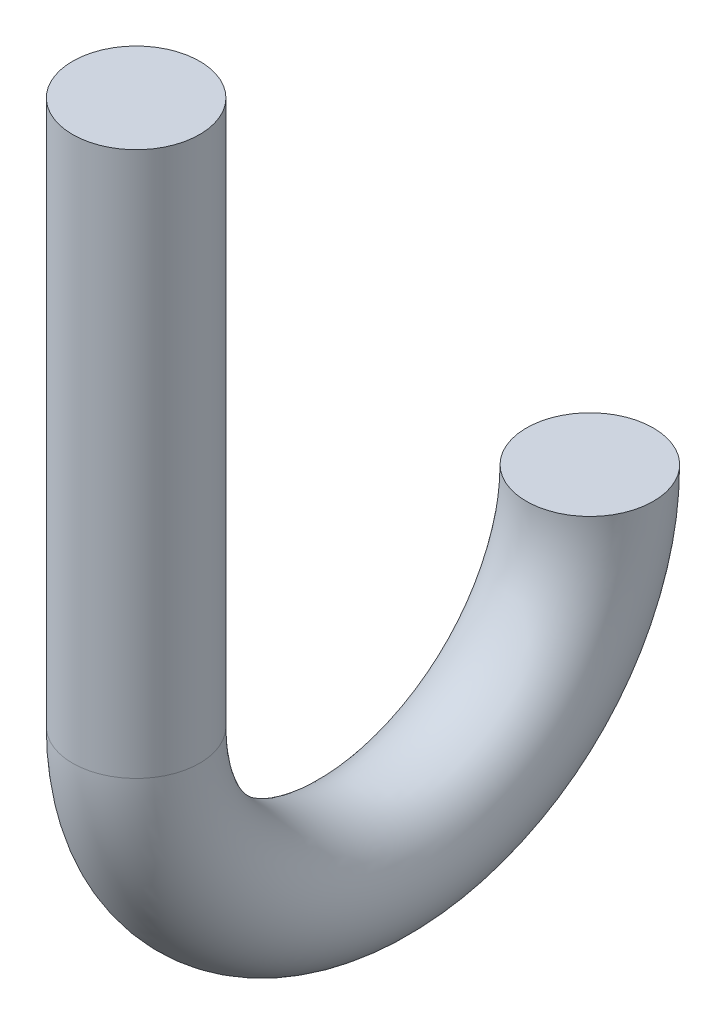
ISO-10303-21;
HEADER;
FILE_DESCRIPTION(('STEP AP214'),'2;1');
FILE_NAME('part.step','',(''),(''),'','','');
FILE_SCHEMA(('AUTOMOTIVE_DESIGN { 1 0 10303 214 1 1 1 1 }'));
ENDSEC;
DATA;
#1=APPLICATION_CONTEXT('core data for automotive mechanical design processes');
#2=APPLICATION_PROTOCOL_DEFINITION('international standard','automotive_design',2000,#1);
#3=PRODUCT_CONTEXT('',#1,'mechanical');
#4=PRODUCT('Part','Part','',(#3));
#5=PRODUCT_RELATED_PRODUCT_CATEGORY('part','',(#4));
#6=PRODUCT_DEFINITION_FORMATION('','',#4);
#7=PRODUCT_DEFINITION_CONTEXT('part definition',#1,'design');
#8=PRODUCT_DEFINITION('design','',#6,#7);
#9=PRODUCT_DEFINITION_SHAPE('','',#8);
#10=(LENGTH_UNIT() NAMED_UNIT(*) SI_UNIT(.MILLI.,.METRE.));
#11=(NAMED_UNIT(*) PLANE_ANGLE_UNIT() SI_UNIT($,.RADIAN.));
#12=(NAMED_UNIT(*) SI_UNIT($,.STERADIAN.) SOLID_ANGLE_UNIT());
#13=UNCERTAINTY_MEASURE_WITH_UNIT(LENGTH_MEASURE(1.E-05),#10,'distance_accuracy_value','');
#14=(GEOMETRIC_REPRESENTATION_CONTEXT(3) GLOBAL_UNCERTAINTY_ASSIGNED_CONTEXT((#13)) GLOBAL_UNIT_ASSIGNED_CONTEXT((#10,
#11,#12)) REPRESENTATION_CONTEXT('',''));
#15=CARTESIAN_POINT('',(0.,0.,0.));
#16=DIRECTION('',(0.,0.,1.));
#17=DIRECTION('',(1.,0.,0.));
#18=AXIS2_PLACEMENT_3D('',#15,#16,#17);
#19=CARTESIAN_POINT('',(0.,30.,0.));
#20=DIRECTION('',(0.,1.,0.));
#21=DIRECTION('',(0.,0.,1.));
#22=AXIS2_PLACEMENT_3D('',#19,#20,#21);
#23=PLANE('',#22);
#24=CARTESIAN_POINT('',(0.,30.,0.));
#25=DIRECTION('',(0.,1.,0.));
#26=DIRECTION('',(0.,0.,1.));
#27=AXIS2_PLACEMENT_3D('',#24,#25,#26);
#28=CIRCLE('',#27,3.5);
#29=CARTESIAN_POINT('',(0.,30.,3.5));
#30=VERTEX_POINT('',#29);
#31=EDGE_CURVE('E47',#30,#30,#28,.T.);
#32=ORIENTED_EDGE('',*,*,#31,.T.);
#33=EDGE_LOOP('',(#32));
#34=FACE_BOUND('',#33,.T.);
#35=ADVANCED_FACE('F37',(#34),#23,.T.);
#36=CARTESIAN_POINT('',(0.,0.,-25.));
#37=DIRECTION('',(0.,-1.,0.));
#38=DIRECTION('',(0.,0.,-1.));
#39=AXIS2_PLACEMENT_3D('',#36,#37,#38);
#40=PLANE('',#39);
#41=CARTESIAN_POINT('',(0.,0.,-25.));
#42=DIRECTION('',(0.,-1.,0.));
#43=DIRECTION('',(0.,0.,-1.));
#44=AXIS2_PLACEMENT_3D('',#41,#42,#43);
#45=CIRCLE('',#44,3.5);
#46=CARTESIAN_POINT('',(0.,0.,-28.5));
#47=VERTEX_POINT('',#46);
#48=EDGE_CURVE('E10',#47,#47,#45,.T.);
#49=ORIENTED_EDGE('',*,*,#48,.F.);
#50=EDGE_LOOP('',(#49));
#51=FACE_BOUND('',#50,.T.);
#52=ADVANCED_FACE('F58',(#51),#40,.F.);
#53=CARTESIAN_POINT('',(0.,30.,0.));
#54=DIRECTION('',(0.,-1.,0.));
#55=DIRECTION('',(0.,0.,-1.));
#56=AXIS2_PLACEMENT_3D('',#53,#54,#55);
#57=CYLINDRICAL_SURFACE('',#56,3.5);
#58=CARTESIAN_POINT('',(0.,0.,0.));
#59=DIRECTION('',(0.,1.,0.));
#60=DIRECTION('',(0.,0.,1.));
#61=AXIS2_PLACEMENT_3D('',#58,#59,#60);
#62=CIRCLE('',#61,3.5);
#63=CARTESIAN_POINT('',(0.,0.,3.5));
#64=VERTEX_POINT('',#63);
#65=EDGE_CURVE('E43',#64,#64,#62,.T.);
#66=ORIENTED_EDGE('',*,*,#65,.T.);
#67=EDGE_LOOP('',(#66));
#68=FACE_BOUND('',#67,.T.);
#69=ORIENTED_EDGE('',*,*,#31,.F.);
#70=EDGE_LOOP('',(#69));
#71=FACE_BOUND('',#70,.T.);
#72=ADVANCED_FACE('F55',(#68,#71),#57,.T.);
#73=CARTESIAN_POINT('',(0.,0.,-12.5));
#74=DIRECTION('',(1.,0.,0.));
#75=DIRECTION('',(0.,0.,-1.));
#76=AXIS2_PLACEMENT_3D('',#73,#74,#75);
#77=TOROIDAL_SURFACE('',#76,12.5,3.5);
#78=CARTESIAN_POINT('',(0.,0.,-12.5));
#79=DIRECTION('',(1.,0.,0.));
#80=DIRECTION('',(0.,0.,-1.));
#81=AXIS2_PLACEMENT_3D('',#78,#79,#80);
#82=CIRCLE('',#81,16.);
#83=EDGE_CURVE('',#64,#47,#82,.T.);
#84=ORIENTED_EDGE('',*,*,#65,.F.);
#85=ORIENTED_EDGE('',*,*,#48,.T.);
#86=ORIENTED_EDGE('',*,*,#83,.T.);
#87=ORIENTED_EDGE('',*,*,#83,.F.);
#88=EDGE_LOOP('',(#84,#86,#85,#87));
#89=FACE_BOUND('',#88,.T.);
#90=ADVANCED_FACE('F57',(#89),#77,.T.);
#91=CLOSED_SHELL('',(#35,#52,#72,#90));
#92=MANIFOLD_SOLID_BREP('B2',#91);
#93=ADVANCED_BREP_SHAPE_REPRESENTATION('',(#18,#92),#14);
#94=SHAPE_DEFINITION_REPRESENTATION(#9,#93);
ENDSEC;
END-ISO-10303-21;
